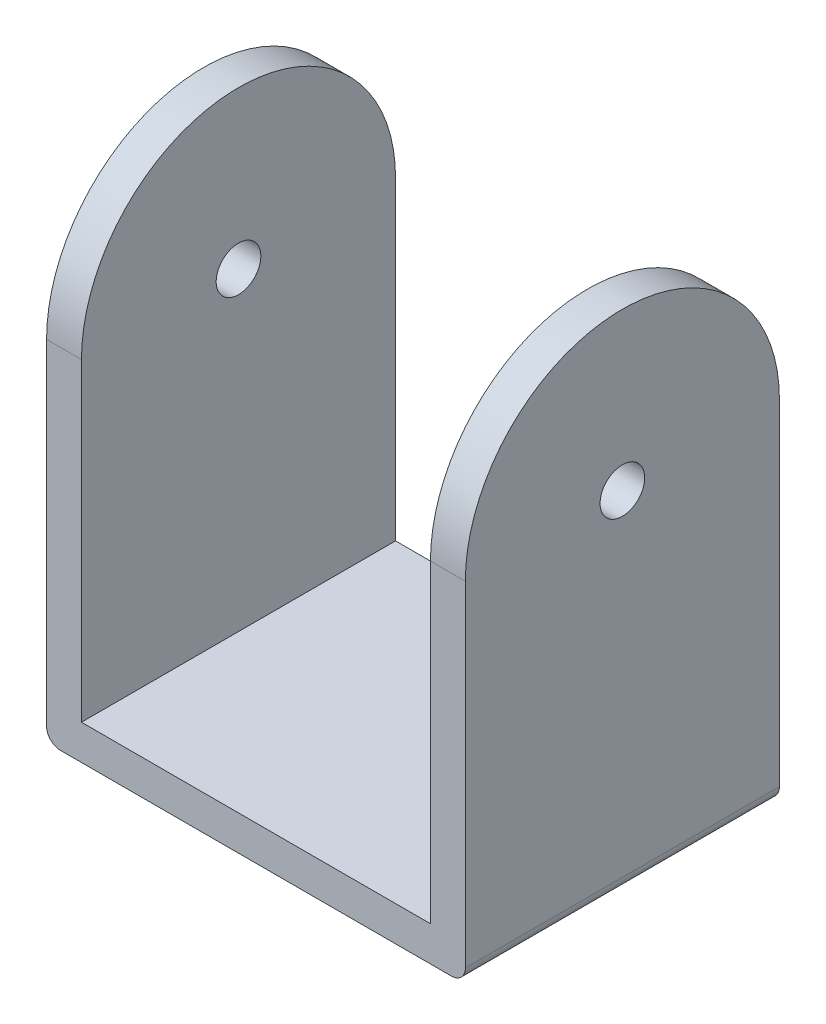
ISO-10303-21;
HEADER;
FILE_DESCRIPTION(('STEP AP214'),'2;1');
FILE_NAME('part.step','',(''),(''),'','','');
FILE_SCHEMA(('AUTOMOTIVE_DESIGN { 1 0 10303 214 1 1 1 1 }'));
ENDSEC;
DATA;
#1=APPLICATION_CONTEXT('core data for automotive mechanical design processes');
#2=APPLICATION_PROTOCOL_DEFINITION('international standard','automotive_design',2000,#1);
#3=PRODUCT_CONTEXT('',#1,'mechanical');
#4=PRODUCT('Part','Part','',(#3));
#5=PRODUCT_RELATED_PRODUCT_CATEGORY('part','',(#4));
#6=PRODUCT_DEFINITION_FORMATION('','',#4);
#7=PRODUCT_DEFINITION_CONTEXT('part definition',#1,'design');
#8=PRODUCT_DEFINITION('design','',#6,#7);
#9=PRODUCT_DEFINITION_SHAPE('','',#8);
#10=(LENGTH_UNIT() NAMED_UNIT(*) SI_UNIT(.MILLI.,.METRE.));
#11=(NAMED_UNIT(*) PLANE_ANGLE_UNIT() SI_UNIT($,.RADIAN.));
#12=(NAMED_UNIT(*) SI_UNIT($,.STERADIAN.) SOLID_ANGLE_UNIT());
#13=UNCERTAINTY_MEASURE_WITH_UNIT(LENGTH_MEASURE(1.E-05),#10,'distance_accuracy_value','');
#14=(GEOMETRIC_REPRESENTATION_CONTEXT(3) GLOBAL_UNCERTAINTY_ASSIGNED_CONTEXT((#13)) GLOBAL_UNIT_ASSIGNED_CONTEXT((#10,
#11,#12)) REPRESENTATION_CONTEXT('',''));
#15=CARTESIAN_POINT('',(0.,0.,0.));
#16=DIRECTION('',(0.,0.,1.));
#17=DIRECTION('',(1.,0.,0.));
#18=AXIS2_PLACEMENT_3D('',#15,#16,#17);
#19=CARTESIAN_POINT('',(2.5,0.,0.));
#20=DIRECTION('',(-1.,0.,0.));
#21=DIRECTION('',(0.,0.,1.));
#22=AXIS2_PLACEMENT_3D('',#19,#20,#21);
#23=CYLINDRICAL_SURFACE('',#22,11.25);
#24=CARTESIAN_POINT('',(0.,0.,0.));
#25=DIRECTION('',(1.,0.,0.));
#26=DIRECTION('',(0.,0.,-1.));
#27=AXIS2_PLACEMENT_3D('',#24,#25,#26);
#28=CIRCLE('',#27,11.25);
#29=CARTESIAN_POINT('',(0.,0.,11.25));
#30=VERTEX_POINT('',#29);
#31=CARTESIAN_POINT('',(0.,0.,-11.25));
#32=VERTEX_POINT('',#31);
#33=EDGE_CURVE('E172',#30,#32,#28,.F.);
#34=ORIENTED_EDGE('',*,*,#33,.F.);
#35=DIRECTION('',(-1.,0.,0.));
#36=VECTOR('',#35,1.);
#37=CARTESIAN_POINT('',(2.5,0.,11.25));
#38=LINE('',#37,#36);
#39=CARTESIAN_POINT('',(2.5,0.,11.25));
#40=VERTEX_POINT('',#39);
#41=EDGE_CURVE('E210',#40,#30,#38,.T.);
#42=ORIENTED_EDGE('',*,*,#41,.F.);
#43=CARTESIAN_POINT('',(2.5,0.,0.));
#44=DIRECTION('',(1.,0.,0.));
#45=DIRECTION('',(0.,0.,-1.));
#46=AXIS2_PLACEMENT_3D('',#43,#44,#45);
#47=CIRCLE('',#46,11.25);
#48=CARTESIAN_POINT('',(2.5,0.,-11.25));
#49=VERTEX_POINT('',#48);
#50=EDGE_CURVE('E182',#40,#49,#47,.F.);
#51=ORIENTED_EDGE('',*,*,#50,.T.);
#52=DIRECTION('',(-1.,0.,0.));
#53=VECTOR('',#52,1.);
#54=CARTESIAN_POINT('',(2.5,0.,-11.25));
#55=LINE('',#54,#53);
#56=EDGE_CURVE('E198',#49,#32,#55,.T.);
#57=ORIENTED_EDGE('',*,*,#56,.T.);
#58=EDGE_LOOP('',(#34,#42,#51,#57));
#59=FACE_BOUND('',#58,.T.);
#60=ADVANCED_FACE('F41',(#59),#23,.T.);
#61=CARTESIAN_POINT('',(2.5,0.,11.25));
#62=DIRECTION('',(0.,0.,1.));
#63=DIRECTION('',(1.,0.,0.));
#64=AXIS2_PLACEMENT_3D('',#61,#62,#63);
#65=PLANE('',#64);
#66=DIRECTION('',(0.,1.,0.));
#67=VECTOR('',#66,1.);
#68=CARTESIAN_POINT('',(0.,0.,11.25));
#69=LINE('',#68,#67);
#70=CARTESIAN_POINT('',(0.,-24.,11.25));
#71=VERTEX_POINT('',#70);
#72=EDGE_CURVE('E202',#71,#30,#69,.T.);
#73=ORIENTED_EDGE('',*,*,#72,.F.);
#74=CARTESIAN_POINT('',(1.,-24.,11.25));
#75=DIRECTION('',(0.,0.,1.));
#76=DIRECTION('',(1.,0.,0.));
#77=AXIS2_PLACEMENT_3D('',#74,#75,#76);
#78=CIRCLE('',#77,1.);
#79=CARTESIAN_POINT('',(1.,-25.,11.25));
#80=VERTEX_POINT('',#79);
#81=EDGE_CURVE('E50',#71,#80,#78,.T.);
#82=ORIENTED_EDGE('',*,*,#81,.T.);
#83=DIRECTION('',(-1.,0.,0.));
#84=VECTOR('',#83,1.);
#85=CARTESIAN_POINT('',(0.,-25.,11.25));
#86=LINE('',#85,#84);
#87=CARTESIAN_POINT('',(29.,-25.,11.25));
#88=VERTEX_POINT('',#87);
#89=EDGE_CURVE('E167',#88,#80,#86,.T.);
#90=ORIENTED_EDGE('',*,*,#89,.F.);
#91=CARTESIAN_POINT('',(29.,-24.,11.25));
#92=DIRECTION('',(0.,0.,1.));
#93=DIRECTION('',(1.,0.,0.));
#94=AXIS2_PLACEMENT_3D('',#91,#92,#93);
#95=CIRCLE('',#94,1.);
#96=CARTESIAN_POINT('',(30.,-24.,11.25));
#97=VERTEX_POINT('',#96);
#98=EDGE_CURVE('E57',#88,#97,#95,.T.);
#99=ORIENTED_EDGE('',*,*,#98,.T.);
#100=DIRECTION('',(0.,1.,0.));
#101=VECTOR('',#100,1.);
#102=CARTESIAN_POINT('',(30.,0.,11.25));
#103=LINE('',#102,#101);
#104=CARTESIAN_POINT('',(30.,0.,11.25));
#105=VERTEX_POINT('',#104);
#106=EDGE_CURVE('E119',#97,#105,#103,.T.);
#107=ORIENTED_EDGE('',*,*,#106,.T.);
#108=DIRECTION('',(-1.,0.,0.));
#109=VECTOR('',#108,1.);
#110=CARTESIAN_POINT('',(30.,0.,11.25));
#111=LINE('',#110,#109);
#112=CARTESIAN_POINT('',(27.5,0.,11.25));
#113=VERTEX_POINT('',#112);
#114=EDGE_CURVE('E123',#105,#113,#111,.T.);
#115=ORIENTED_EDGE('',*,*,#114,.T.);
#116=DIRECTION('',(0.,1.,0.));
#117=VECTOR('',#116,1.);
#118=CARTESIAN_POINT('',(27.5,0.,11.25));
#119=LINE('',#118,#117);
#120=CARTESIAN_POINT('',(27.5,-22.5,11.25));
#121=VERTEX_POINT('',#120);
#122=EDGE_CURVE('E149',#121,#113,#119,.T.);
#123=ORIENTED_EDGE('',*,*,#122,.F.);
#124=DIRECTION('',(-1.,0.,0.));
#125=VECTOR('',#124,1.);
#126=CARTESIAN_POINT('',(0.,-22.5,11.25));
#127=LINE('',#126,#125);
#128=CARTESIAN_POINT('',(2.5,-22.5,11.25));
#129=VERTEX_POINT('',#128);
#130=EDGE_CURVE('E168',#121,#129,#127,.T.);
#131=ORIENTED_EDGE('',*,*,#130,.T.);
#132=DIRECTION('',(0.,1.,0.));
#133=VECTOR('',#132,1.);
#134=CARTESIAN_POINT('',(2.5,0.,11.25));
#135=LINE('',#134,#133);
#136=EDGE_CURVE('E186',#129,#40,#135,.T.);
#137=ORIENTED_EDGE('',*,*,#136,.T.);
#138=ORIENTED_EDGE('',*,*,#41,.T.);
#139=EDGE_LOOP('',(#73,#82,#90,#99,#107,#115,#123,#131,#137,#138));
#140=FACE_BOUND('',#139,.T.);
#141=ADVANCED_FACE('F121',(#140),#65,.T.);
#142=CARTESIAN_POINT('',(2.5,0.,-11.25));
#143=DIRECTION('',(0.,0.,1.));
#144=DIRECTION('',(1.,0.,0.));
#145=AXIS2_PLACEMENT_3D('',#142,#143,#144);
#146=PLANE('',#145);
#147=DIRECTION('',(1.,0.,0.));
#148=VECTOR('',#147,1.);
#149=CARTESIAN_POINT('',(0.,-25.,-11.25));
#150=LINE('',#149,#148);
#151=CARTESIAN_POINT('',(1.,-25.,-11.25));
#152=VERTEX_POINT('',#151);
#153=CARTESIAN_POINT('',(29.,-25.,-11.25));
#154=VERTEX_POINT('',#153);
#155=EDGE_CURVE('E163',#152,#154,#150,.T.);
#156=ORIENTED_EDGE('',*,*,#155,.F.);
#157=CARTESIAN_POINT('',(1.,-24.,-11.25));
#158=DIRECTION('',(0.,0.,1.));
#159=DIRECTION('',(1.,0.,0.));
#160=AXIS2_PLACEMENT_3D('',#157,#158,#159);
#161=CIRCLE('',#160,1.);
#162=CARTESIAN_POINT('',(0.,-24.,-11.25));
#163=VERTEX_POINT('',#162);
#164=EDGE_CURVE('E224',#152,#163,#161,.F.);
#165=ORIENTED_EDGE('',*,*,#164,.T.);
#166=DIRECTION('',(0.,1.,0.));
#167=VECTOR('',#166,1.);
#168=CARTESIAN_POINT('',(0.,0.,-11.25));
#169=LINE('',#168,#167);
#170=EDGE_CURVE('E187',#163,#32,#169,.T.);
#171=ORIENTED_EDGE('',*,*,#170,.T.);
#172=ORIENTED_EDGE('',*,*,#56,.F.);
#173=DIRECTION('',(0.,1.,0.));
#174=VECTOR('',#173,1.);
#175=CARTESIAN_POINT('',(2.5,0.,-11.25));
#176=LINE('',#175,#174);
#177=CARTESIAN_POINT('',(2.5,-22.5,-11.25));
#178=VERTEX_POINT('',#177);
#179=EDGE_CURVE('E195',#178,#49,#176,.T.);
#180=ORIENTED_EDGE('',*,*,#179,.F.);
#181=DIRECTION('',(1.,0.,0.));
#182=VECTOR('',#181,1.);
#183=CARTESIAN_POINT('',(0.,-22.5,-11.25));
#184=LINE('',#183,#182);
#185=CARTESIAN_POINT('',(27.5,-22.5,-11.25));
#186=VERTEX_POINT('',#185);
#187=EDGE_CURVE('E139',#178,#186,#184,.T.);
#188=ORIENTED_EDGE('',*,*,#187,.T.);
#189=DIRECTION('',(0.,1.,0.));
#190=VECTOR('',#189,1.);
#191=CARTESIAN_POINT('',(27.5,0.,-11.25));
#192=LINE('',#191,#190);
#193=CARTESIAN_POINT('',(27.5,0.,-11.25));
#194=VERTEX_POINT('',#193);
#195=EDGE_CURVE('E146',#186,#194,#192,.T.);
#196=ORIENTED_EDGE('',*,*,#195,.T.);
#197=DIRECTION('',(-1.,0.,0.));
#198=VECTOR('',#197,1.);
#199=CARTESIAN_POINT('',(30.,0.,-11.25));
#200=LINE('',#199,#198);
#201=CARTESIAN_POINT('',(30.,0.,-11.25));
#202=VERTEX_POINT('',#201);
#203=EDGE_CURVE('E140',#202,#194,#200,.T.);
#204=ORIENTED_EDGE('',*,*,#203,.F.);
#205=DIRECTION('',(0.,1.,0.));
#206=VECTOR('',#205,1.);
#207=CARTESIAN_POINT('',(30.,0.,-11.25));
#208=LINE('',#207,#206);
#209=CARTESIAN_POINT('',(30.,-24.,-11.25));
#210=VERTEX_POINT('',#209);
#211=EDGE_CURVE('E129',#210,#202,#208,.T.);
#212=ORIENTED_EDGE('',*,*,#211,.F.);
#213=CARTESIAN_POINT('',(29.,-24.,-11.25));
#214=DIRECTION('',(0.,0.,1.));
#215=DIRECTION('',(1.,0.,0.));
#216=AXIS2_PLACEMENT_3D('',#213,#214,#215);
#217=CIRCLE('',#216,1.);
#218=EDGE_CURVE('E221',#210,#154,#217,.F.);
#219=ORIENTED_EDGE('',*,*,#218,.T.);
#220=EDGE_LOOP('',(#156,#165,#171,#172,#180,#188,#196,#204,#212,#219));
#221=FACE_BOUND('',#220,.T.);
#222=ADVANCED_FACE('F240',(#221),#146,.F.);
#223=CARTESIAN_POINT('',(2.5,0.,0.));
#224=DIRECTION('',(1.,0.,0.));
#225=DIRECTION('',(0.,0.,-1.));
#226=AXIS2_PLACEMENT_3D('',#223,#224,#225);
#227=PLANE('',#226);
#228=CARTESIAN_POINT('',(2.5,0.,0.));
#229=DIRECTION('',(1.,0.,0.));
#230=DIRECTION('',(0.,0.,-1.));
#231=AXIS2_PLACEMENT_3D('',#228,#229,#230);
#232=CIRCLE('',#231,1.6);
#233=CARTESIAN_POINT('',(2.5,0.,-1.59999999999999));
#234=VERTEX_POINT('',#233);
#235=EDGE_CURVE('E152',#234,#234,#232,.T.);
#236=ORIENTED_EDGE('',*,*,#235,.F.);
#237=EDGE_LOOP('',(#236));
#238=FACE_BOUND('',#237,.T.);
#239=ORIENTED_EDGE('',*,*,#50,.F.);
#240=ORIENTED_EDGE('',*,*,#136,.F.);
#241=DIRECTION('',(0.,0.,-1.));
#242=VECTOR('',#241,1.);
#243=CARTESIAN_POINT('',(2.5,-22.5,0.));
#244=LINE('',#243,#242);
#245=EDGE_CURVE('E191',#129,#178,#244,.T.);
#246=ORIENTED_EDGE('',*,*,#245,.T.);
#247=ORIENTED_EDGE('',*,*,#179,.T.);
#248=EDGE_LOOP('',(#239,#240,#246,#247));
#249=FACE_BOUND('',#248,.T.);
#250=ADVANCED_FACE('F249',(#238,#249),#227,.T.);
#251=CARTESIAN_POINT('',(0.,0.,0.));
#252=DIRECTION('',(1.,0.,0.));
#253=DIRECTION('',(0.,0.,-1.));
#254=AXIS2_PLACEMENT_3D('',#251,#252,#253);
#255=PLANE('',#254);
#256=CARTESIAN_POINT('',(0.,0.,0.));
#257=DIRECTION('',(1.,0.,0.));
#258=DIRECTION('',(0.,0.,-1.));
#259=AXIS2_PLACEMENT_3D('',#256,#257,#258);
#260=CIRCLE('',#259,1.6);
#261=CARTESIAN_POINT('',(0.,0.,-1.59999999999999));
#262=VERTEX_POINT('',#261);
#263=EDGE_CURVE('E301',#262,#262,#260,.T.);
#264=ORIENTED_EDGE('',*,*,#263,.T.);
#265=EDGE_LOOP('',(#264));
#266=FACE_BOUND('',#265,.T.);
#267=ORIENTED_EDGE('',*,*,#170,.F.);
#268=DIRECTION('',(0.,0.,-1.));
#269=VECTOR('',#268,1.);
#270=CARTESIAN_POINT('',(0.,-24.,11.25));
#271=LINE('',#270,#269);
#272=EDGE_CURVE('E65',#163,#71,#271,.F.);
#273=ORIENTED_EDGE('',*,*,#272,.T.);
#274=ORIENTED_EDGE('',*,*,#72,.T.);
#275=ORIENTED_EDGE('',*,*,#33,.T.);
#276=EDGE_LOOP('',(#267,#273,#274,#275));
#277=FACE_BOUND('',#276,.T.);
#278=ADVANCED_FACE('F242',(#266,#277),#255,.F.);
#279=CARTESIAN_POINT('',(0.,-25.,0.));
#280=DIRECTION('',(0.,-1.,0.));
#281=DIRECTION('',(0.,0.,-1.));
#282=AXIS2_PLACEMENT_3D('',#279,#280,#281);
#283=PLANE('',#282);
#284=ORIENTED_EDGE('',*,*,#89,.T.);
#285=DIRECTION('',(0.,0.,-1.));
#286=VECTOR('',#285,1.);
#287=CARTESIAN_POINT('',(1.,-25.,-11.25));
#288=LINE('',#287,#286);
#289=EDGE_CURVE('E217',#80,#152,#288,.T.);
#290=ORIENTED_EDGE('',*,*,#289,.T.);
#291=ORIENTED_EDGE('',*,*,#155,.T.);
#292=DIRECTION('',(0.,0.,-1.));
#293=VECTOR('',#292,1.);
#294=CARTESIAN_POINT('',(29.,-25.,0.));
#295=LINE('',#294,#293);
#296=EDGE_CURVE('E214',#154,#88,#295,.F.);
#297=ORIENTED_EDGE('',*,*,#296,.T.);
#298=EDGE_LOOP('',(#284,#290,#291,#297));
#299=FACE_BOUND('',#298,.T.);
#300=ADVANCED_FACE('F235',(#299),#283,.T.);
#301=CARTESIAN_POINT('',(0.,-22.5,0.));
#302=DIRECTION('',(0.,-1.,0.));
#303=DIRECTION('',(0.,0.,-1.));
#304=AXIS2_PLACEMENT_3D('',#301,#302,#303);
#305=PLANE('',#304);
#306=ORIENTED_EDGE('',*,*,#245,.F.);
#307=ORIENTED_EDGE('',*,*,#130,.F.);
#308=DIRECTION('',(0.,0.,1.));
#309=VECTOR('',#308,1.);
#310=CARTESIAN_POINT('',(27.5,-22.5,11.25));
#311=LINE('',#310,#309);
#312=EDGE_CURVE('E175',#186,#121,#311,.T.);
#313=ORIENTED_EDGE('',*,*,#312,.F.);
#314=ORIENTED_EDGE('',*,*,#187,.F.);
#315=EDGE_LOOP('',(#306,#307,#313,#314));
#316=FACE_BOUND('',#315,.T.);
#317=ADVANCED_FACE('F252',(#316),#305,.F.);
#318=CARTESIAN_POINT('',(27.5,0.,0.));
#319=DIRECTION('',(1.,0.,0.));
#320=DIRECTION('',(0.,0.,-1.));
#321=AXIS2_PLACEMENT_3D('',#318,#319,#320);
#322=PLANE('',#321);
#323=CARTESIAN_POINT('',(27.5,0.,0.));
#324=DIRECTION('',(1.,0.,0.));
#325=DIRECTION('',(0.,0.,-1.));
#326=AXIS2_PLACEMENT_3D('',#323,#324,#325);
#327=CIRCLE('',#326,1.6);
#328=CARTESIAN_POINT('',(27.5,0.,-1.59999999999999));
#329=VERTEX_POINT('',#328);
#330=EDGE_CURVE('E303',#329,#329,#327,.T.);
#331=ORIENTED_EDGE('',*,*,#330,.T.);
#332=EDGE_LOOP('',(#331));
#333=FACE_BOUND('',#332,.T.);
#334=ORIENTED_EDGE('',*,*,#195,.F.);
#335=ORIENTED_EDGE('',*,*,#312,.T.);
#336=ORIENTED_EDGE('',*,*,#122,.T.);
#337=CARTESIAN_POINT('',(27.5,0.,0.));
#338=DIRECTION('',(1.,0.,0.));
#339=DIRECTION('',(0.,0.,-1.));
#340=AXIS2_PLACEMENT_3D('',#337,#338,#339);
#341=CIRCLE('',#340,11.25);
#342=EDGE_CURVE('E137',#113,#194,#341,.F.);
#343=ORIENTED_EDGE('',*,*,#342,.T.);
#344=EDGE_LOOP('',(#334,#335,#336,#343));
#345=FACE_BOUND('',#344,.T.);
#346=ADVANCED_FACE('F255',(#333,#345),#322,.F.);
#347=CARTESIAN_POINT('',(30.,0.,0.));
#348=DIRECTION('',(-1.,0.,0.));
#349=DIRECTION('',(0.,0.,1.));
#350=AXIS2_PLACEMENT_3D('',#347,#348,#349);
#351=CYLINDRICAL_SURFACE('',#350,11.25);
#352=ORIENTED_EDGE('',*,*,#342,.F.);
#353=ORIENTED_EDGE('',*,*,#114,.F.);
#354=CARTESIAN_POINT('',(30.,0.,0.));
#355=DIRECTION('',(1.,0.,0.));
#356=DIRECTION('',(0.,0.,-1.));
#357=AXIS2_PLACEMENT_3D('',#354,#355,#356);
#358=CIRCLE('',#357,11.25);
#359=EDGE_CURVE('E130',#105,#202,#358,.F.);
#360=ORIENTED_EDGE('',*,*,#359,.T.);
#361=ORIENTED_EDGE('',*,*,#203,.T.);
#362=EDGE_LOOP('',(#352,#353,#360,#361));
#363=FACE_BOUND('',#362,.T.);
#364=ADVANCED_FACE('F134',(#363),#351,.T.);
#365=CARTESIAN_POINT('',(30.,0.,0.));
#366=DIRECTION('',(1.,0.,0.));
#367=DIRECTION('',(0.,0.,-1.));
#368=AXIS2_PLACEMENT_3D('',#365,#366,#367);
#369=PLANE('',#368);
#370=CARTESIAN_POINT('',(30.,0.,0.));
#371=DIRECTION('',(1.,0.,0.));
#372=DIRECTION('',(0.,0.,-1.));
#373=AXIS2_PLACEMENT_3D('',#370,#371,#372);
#374=CIRCLE('',#373,1.6);
#375=CARTESIAN_POINT('',(30.,0.,-1.59999999999999));
#376=VERTEX_POINT('',#375);
#377=EDGE_CURVE('E304',#376,#376,#374,.T.);
#378=ORIENTED_EDGE('',*,*,#377,.F.);
#379=EDGE_LOOP('',(#378));
#380=FACE_BOUND('',#379,.T.);
#381=ORIENTED_EDGE('',*,*,#106,.F.);
#382=DIRECTION('',(0.,0.,-1.));
#383=VECTOR('',#382,1.);
#384=CARTESIAN_POINT('',(30.,-24.,0.));
#385=LINE('',#384,#383);
#386=EDGE_CURVE('E11',#97,#210,#385,.T.);
#387=ORIENTED_EDGE('',*,*,#386,.T.);
#388=ORIENTED_EDGE('',*,*,#211,.T.);
#389=ORIENTED_EDGE('',*,*,#359,.F.);
#390=EDGE_LOOP('',(#381,#387,#388,#389));
#391=FACE_BOUND('',#390,.T.);
#392=ADVANCED_FACE('F142',(#380,#391),#369,.T.);
#393=CARTESIAN_POINT('',(0.,0.,0.));
#394=DIRECTION('',(1.,0.,0.));
#395=DIRECTION('',(0.,0.,-1.));
#396=AXIS2_PLACEMENT_3D('',#393,#394,#395);
#397=CYLINDRICAL_SURFACE('',#396,1.6);
#398=ORIENTED_EDGE('',*,*,#377,.T.);
#399=EDGE_LOOP('',(#398));
#400=FACE_BOUND('',#399,.T.);
#401=ORIENTED_EDGE('',*,*,#330,.F.);
#402=EDGE_LOOP('',(#401));
#403=FACE_BOUND('',#402,.T.);
#404=ADVANCED_FACE('F288',(#400,#403),#397,.F.);
#405=ORIENTED_EDGE('',*,*,#235,.T.);
#406=EDGE_LOOP('',(#405));
#407=FACE_BOUND('',#406,.T.);
#408=ORIENTED_EDGE('',*,*,#263,.F.);
#409=EDGE_LOOP('',(#408));
#410=FACE_BOUND('',#409,.T.);
#411=ADVANCED_FACE('F261',(#407,#410),#397,.F.);
#412=CARTESIAN_POINT('',(1.,-24.,0.));
#413=DIRECTION('',(0.,0.,1.));
#414=DIRECTION('',(1.,0.,0.));
#415=AXIS2_PLACEMENT_3D('',#412,#413,#414);
#416=CYLINDRICAL_SURFACE('',#415,1.);
#417=ORIENTED_EDGE('',*,*,#81,.F.);
#418=ORIENTED_EDGE('',*,*,#272,.F.);
#419=ORIENTED_EDGE('',*,*,#164,.F.);
#420=ORIENTED_EDGE('',*,*,#289,.F.);
#421=EDGE_LOOP('',(#417,#418,#419,#420));
#422=FACE_BOUND('',#421,.T.);
#423=ADVANCED_FACE('F238',(#422),#416,.T.);
#424=CARTESIAN_POINT('',(29.,-24.,0.));
#425=DIRECTION('',(0.,0.,-1.));
#426=DIRECTION('',(-1.,0.,0.));
#427=AXIS2_PLACEMENT_3D('',#424,#425,#426);
#428=CYLINDRICAL_SURFACE('',#427,1.);
#429=ORIENTED_EDGE('',*,*,#98,.F.);
#430=ORIENTED_EDGE('',*,*,#296,.F.);
#431=ORIENTED_EDGE('',*,*,#218,.F.);
#432=ORIENTED_EDGE('',*,*,#386,.F.);
#433=EDGE_LOOP('',(#429,#430,#431,#432));
#434=FACE_BOUND('',#433,.T.);
#435=ADVANCED_FACE('F43',(#434),#428,.T.);
#436=CLOSED_SHELL('',(#60,#141,#222,#250,#278,#300,#317,#346,#364,#392,#404,#411,#423,#435));
#437=MANIFOLD_SOLID_BREP('B2',#436);
#438=ADVANCED_BREP_SHAPE_REPRESENTATION('',(#18,#437),#14);
#439=SHAPE_DEFINITION_REPRESENTATION(#9,#438);
ENDSEC;
END-ISO-10303-21;
